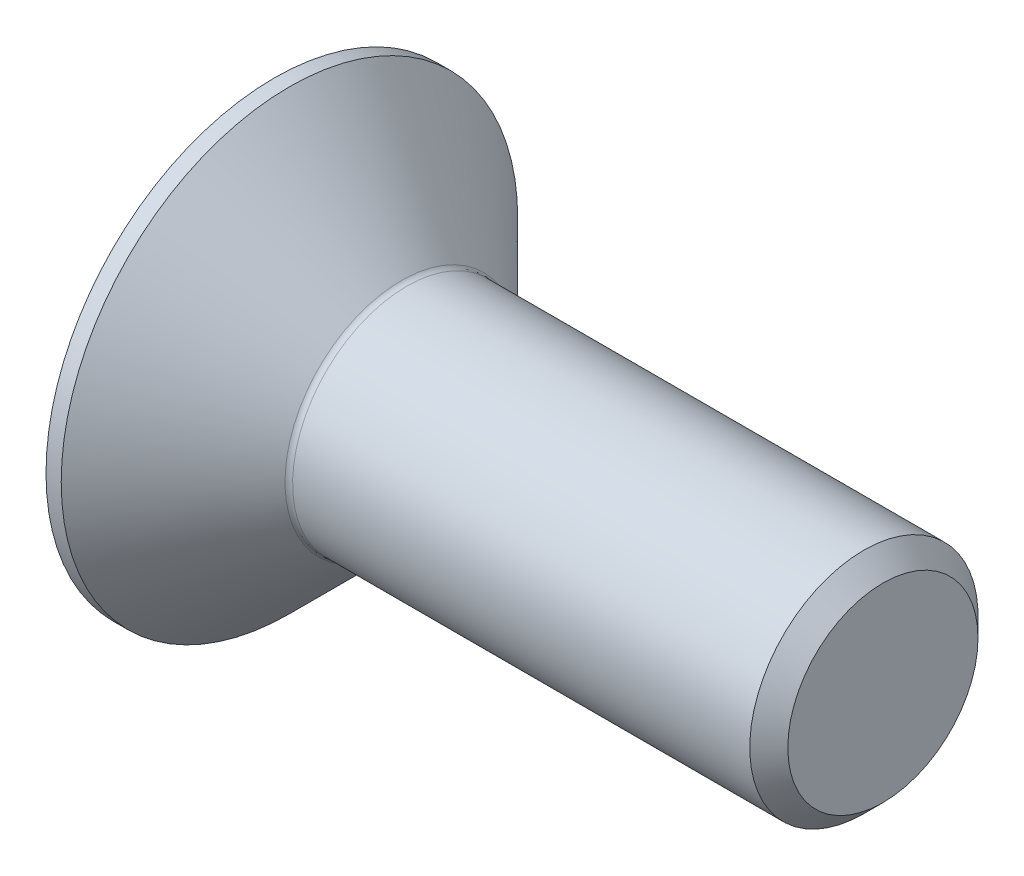
ISO-10303-21;
HEADER;
FILE_DESCRIPTION(('STEP AP214'),'2;1');
FILE_NAME('part.step','',(''),(''),'','','');
FILE_SCHEMA(('AUTOMOTIVE_DESIGN { 1 0 10303 214 1 1 1 1 }'));
ENDSEC;
DATA;
#1=APPLICATION_CONTEXT('core data for automotive mechanical design processes');
#2=APPLICATION_PROTOCOL_DEFINITION('international standard','automotive_design',2000,#1);
#3=PRODUCT_CONTEXT('',#1,'mechanical');
#4=PRODUCT('Part','Part','',(#3));
#5=PRODUCT_RELATED_PRODUCT_CATEGORY('part','',(#4));
#6=PRODUCT_DEFINITION_FORMATION('','',#4);
#7=PRODUCT_DEFINITION_CONTEXT('part definition',#1,'design');
#8=PRODUCT_DEFINITION('design','',#6,#7);
#9=PRODUCT_DEFINITION_SHAPE('','',#8);
#10=(LENGTH_UNIT() NAMED_UNIT(*) SI_UNIT(.MILLI.,.METRE.));
#11=(NAMED_UNIT(*) PLANE_ANGLE_UNIT() SI_UNIT($,.RADIAN.));
#12=(NAMED_UNIT(*) SI_UNIT($,.STERADIAN.) SOLID_ANGLE_UNIT());
#13=UNCERTAINTY_MEASURE_WITH_UNIT(LENGTH_MEASURE(1.E-05),#10,'distance_accuracy_value','');
#14=(GEOMETRIC_REPRESENTATION_CONTEXT(3) GLOBAL_UNCERTAINTY_ASSIGNED_CONTEXT((#13)) GLOBAL_UNIT_ASSIGNED_CONTEXT((#10,
#11,#12)) REPRESENTATION_CONTEXT('',''));
#15=CARTESIAN_POINT('',(0.,0.,0.));
#16=DIRECTION('',(0.,0.,1.));
#17=DIRECTION('',(1.,0.,0.));
#18=AXIS2_PLACEMENT_3D('',#15,#16,#17);
#19=CARTESIAN_POINT('',(1.2,0.,0.));
#20=DIRECTION('',(1.,0.,0.));
#21=DIRECTION('',(0.,1.,0.));
#22=AXIS2_PLACEMENT_3D('',#19,#20,#21);
#23=PLANE('',#22);
#24=DIRECTION('',(0.,-0.5,-0.866025403784439));
#25=VECTOR('',#24,1.);
#26=CARTESIAN_POINT('',(1.2,-1.15470053837925,0.));
#27=LINE('',#26,#25);
#28=CARTESIAN_POINT('',(1.2,-1.15470053837925,0.));
#29=VERTEX_POINT('',#28);
#30=CARTESIAN_POINT('',(1.2,-0.577350269189626,1.));
#31=VERTEX_POINT('',#30);
#32=EDGE_CURVE('E123',#29,#31,#27,.F.);
#33=ORIENTED_EDGE('',*,*,#32,.T.);
#34=DIRECTION('',(0.,-1.,0.));
#35=VECTOR('',#34,1.);
#36=CARTESIAN_POINT('',(1.2,-0.577350269189626,1.));
#37=LINE('',#36,#35);
#38=CARTESIAN_POINT('',(1.2,0.577350269189626,1.));
#39=VERTEX_POINT('',#38);
#40=EDGE_CURVE('E127',#31,#39,#37,.F.);
#41=ORIENTED_EDGE('',*,*,#40,.T.);
#42=DIRECTION('',(0.,-0.499999999999999,0.866025403784439));
#43=VECTOR('',#42,1.);
#44=CARTESIAN_POINT('',(1.2,0.577350269189626,1.));
#45=LINE('',#44,#43);
#46=CARTESIAN_POINT('',(1.2,1.15470053837925,0.));
#47=VERTEX_POINT('',#46);
#48=EDGE_CURVE('E132',#39,#47,#45,.F.);
#49=ORIENTED_EDGE('',*,*,#48,.T.);
#50=DIRECTION('',(0.,0.5,0.866025403784439));
#51=VECTOR('',#50,1.);
#52=CARTESIAN_POINT('',(1.2,1.15470053837925,0.));
#53=LINE('',#52,#51);
#54=CARTESIAN_POINT('',(1.2,0.577350269189626,-1.));
#55=VERTEX_POINT('',#54);
#56=EDGE_CURVE('E82',#47,#55,#53,.F.);
#57=ORIENTED_EDGE('',*,*,#56,.T.);
#58=DIRECTION('',(0.,1.,0.));
#59=VECTOR('',#58,1.);
#60=CARTESIAN_POINT('',(1.2,0.577350269189626,-1.));
#61=LINE('',#60,#59);
#62=CARTESIAN_POINT('',(1.2,-0.577350269189627,-1.));
#63=VERTEX_POINT('',#62);
#64=EDGE_CURVE('E66',#55,#63,#61,.F.);
#65=ORIENTED_EDGE('',*,*,#64,.T.);
#66=DIRECTION('',(0.,0.499999999999999,-0.866025403784439));
#67=VECTOR('',#66,1.);
#68=CARTESIAN_POINT('',(1.2,-0.577350269189627,-1.));
#69=LINE('',#68,#67);
#70=EDGE_CURVE('E71',#63,#29,#69,.F.);
#71=ORIENTED_EDGE('',*,*,#70,.T.);
#72=EDGE_LOOP('',(#33,#41,#49,#57,#65,#71));
#73=FACE_BOUND('',#72,.T.);
#74=ADVANCED_FACE('F16',(#73),#23,.F.);
#75=CARTESIAN_POINT('',(0.,-0.577350269189626,-1.));
#76=DIRECTION('',(0.,-0.866025403784439,-0.499999999999999));
#77=DIRECTION('',(0.,0.499999999999999,-0.866025403784439));
#78=AXIS2_PLACEMENT_3D('',#75,#76,#77);
#79=PLANE('',#78);
#80=DIRECTION('',(1.,0.,0.));
#81=VECTOR('',#80,1.);
#82=CARTESIAN_POINT('',(0.,-0.577350269189627,-1.));
#83=LINE('',#82,#81);
#84=CARTESIAN_POINT('',(0.,-0.577350269189626,-1.));
#85=VERTEX_POINT('',#84);
#86=EDGE_CURVE('E73',#63,#85,#83,.F.);
#87=ORIENTED_EDGE('',*,*,#86,.T.);
#88=DIRECTION('',(0.,0.499999999999999,-0.866025403784439));
#89=VECTOR('',#88,1.);
#90=CARTESIAN_POINT('',(0.,-1.15470053837925,0.));
#91=LINE('',#90,#89);
#92=CARTESIAN_POINT('',(0.,-1.15470053837925,0.));
#93=VERTEX_POINT('',#92);
#94=EDGE_CURVE('E121',#93,#85,#91,.T.);
#95=ORIENTED_EDGE('',*,*,#94,.F.);
#96=DIRECTION('',(1.,0.,0.));
#97=VECTOR('',#96,1.);
#98=CARTESIAN_POINT('',(0.,-1.15470053837925,0.));
#99=LINE('',#98,#97);
#100=EDGE_CURVE('E76',#93,#29,#99,.T.);
#101=ORIENTED_EDGE('',*,*,#100,.T.);
#102=ORIENTED_EDGE('',*,*,#70,.F.);
#103=EDGE_LOOP('',(#87,#95,#101,#102));
#104=FACE_BOUND('',#103,.T.);
#105=ADVANCED_FACE('F72',(#104),#79,.F.);
#106=CARTESIAN_POINT('',(0.,0.577350269189626,-1.));
#107=DIRECTION('',(0.,0.,-1.));
#108=DIRECTION('',(0.,1.,0.));
#109=AXIS2_PLACEMENT_3D('',#106,#107,#108);
#110=PLANE('',#109);
#111=DIRECTION('',(1.,0.,0.));
#112=VECTOR('',#111,1.);
#113=CARTESIAN_POINT('',(0.,0.577350269189625,-1.));
#114=LINE('',#113,#112);
#115=CARTESIAN_POINT('',(0.,0.577350269189626,-1.));
#116=VERTEX_POINT('',#115);
#117=EDGE_CURVE('E84',#55,#116,#114,.F.);
#118=ORIENTED_EDGE('',*,*,#117,.T.);
#119=DIRECTION('',(0.,-1.,0.));
#120=VECTOR('',#119,1.);
#121=CARTESIAN_POINT('',(0.,-1.5,-1.));
#122=LINE('',#121,#120);
#123=EDGE_CURVE('E88',#85,#116,#122,.F.);
#124=ORIENTED_EDGE('',*,*,#123,.F.);
#125=ORIENTED_EDGE('',*,*,#86,.F.);
#126=ORIENTED_EDGE('',*,*,#64,.F.);
#127=EDGE_LOOP('',(#118,#124,#125,#126));
#128=FACE_BOUND('',#127,.T.);
#129=ADVANCED_FACE('F86',(#128),#110,.F.);
#130=CARTESIAN_POINT('',(0.,1.15470053837925,0.));
#131=DIRECTION('',(0.,0.866025403784439,-0.5));
#132=DIRECTION('',(0.,0.5,0.866025403784439));
#133=AXIS2_PLACEMENT_3D('',#130,#131,#132);
#134=PLANE('',#133);
#135=DIRECTION('',(1.,0.,0.));
#136=VECTOR('',#135,1.);
#137=CARTESIAN_POINT('',(0.,1.15470053837925,0.));
#138=LINE('',#137,#136);
#139=CARTESIAN_POINT('',(0.,1.15470053837925,0.));
#140=VERTEX_POINT('',#139);
#141=EDGE_CURVE('E134',#47,#140,#138,.F.);
#142=ORIENTED_EDGE('',*,*,#141,.T.);
#143=DIRECTION('',(0.,0.499999999999999,0.866025403784439));
#144=VECTOR('',#143,1.);
#145=CARTESIAN_POINT('',(0.,0.577350269189626,-1.));
#146=LINE('',#145,#144);
#147=EDGE_CURVE('E117',#116,#140,#146,.T.);
#148=ORIENTED_EDGE('',*,*,#147,.F.);
#149=ORIENTED_EDGE('',*,*,#117,.F.);
#150=ORIENTED_EDGE('',*,*,#56,.F.);
#151=EDGE_LOOP('',(#142,#148,#149,#150));
#152=FACE_BOUND('',#151,.T.);
#153=ADVANCED_FACE('F138',(#152),#134,.F.);
#154=CARTESIAN_POINT('',(0.,0.577350269189626,1.));
#155=DIRECTION('',(0.,0.866025403784439,0.499999999999999));
#156=DIRECTION('',(0.,-0.499999999999999,0.866025403784439));
#157=AXIS2_PLACEMENT_3D('',#154,#155,#156);
#158=PLANE('',#157);
#159=DIRECTION('',(1.,0.,0.));
#160=VECTOR('',#159,1.);
#161=CARTESIAN_POINT('',(0.,0.577350269189626,1.));
#162=LINE('',#161,#160);
#163=CARTESIAN_POINT('',(0.,0.577350269189626,1.));
#164=VERTEX_POINT('',#163);
#165=EDGE_CURVE('E130',#39,#164,#162,.F.);
#166=ORIENTED_EDGE('',*,*,#165,.T.);
#167=DIRECTION('',(0.,-0.499999999999999,0.866025403784439));
#168=VECTOR('',#167,1.);
#169=CARTESIAN_POINT('',(0.,1.15470053837925,0.));
#170=LINE('',#169,#168);
#171=EDGE_CURVE('E114',#140,#164,#170,.T.);
#172=ORIENTED_EDGE('',*,*,#171,.F.);
#173=ORIENTED_EDGE('',*,*,#141,.F.);
#174=ORIENTED_EDGE('',*,*,#48,.F.);
#175=EDGE_LOOP('',(#166,#172,#173,#174));
#176=FACE_BOUND('',#175,.T.);
#177=ADVANCED_FACE('F149',(#176),#158,.F.);
#178=CARTESIAN_POINT('',(0.,-0.577350269189626,1.));
#179=DIRECTION('',(0.,0.,1.));
#180=DIRECTION('',(0.,-1.,0.));
#181=AXIS2_PLACEMENT_3D('',#178,#179,#180);
#182=PLANE('',#181);
#183=DIRECTION('',(1.,0.,0.));
#184=VECTOR('',#183,1.);
#185=CARTESIAN_POINT('',(0.,-0.577350269189625,1.));
#186=LINE('',#185,#184);
#187=CARTESIAN_POINT('',(0.,-0.577350269189626,1.));
#188=VERTEX_POINT('',#187);
#189=EDGE_CURVE('E34',#31,#188,#186,.F.);
#190=ORIENTED_EDGE('',*,*,#189,.T.);
#191=DIRECTION('',(0.,-1.,0.));
#192=VECTOR('',#191,1.);
#193=CARTESIAN_POINT('',(0.,-1.5,1.));
#194=LINE('',#193,#192);
#195=EDGE_CURVE('E111',#164,#188,#194,.T.);
#196=ORIENTED_EDGE('',*,*,#195,.F.);
#197=ORIENTED_EDGE('',*,*,#165,.F.);
#198=ORIENTED_EDGE('',*,*,#40,.F.);
#199=EDGE_LOOP('',(#190,#196,#197,#198));
#200=FACE_BOUND('',#199,.T.);
#201=ADVANCED_FACE('F147',(#200),#182,.F.);
#202=CARTESIAN_POINT('',(0.,-1.15470053837925,0.));
#203=DIRECTION('',(0.,-0.866025403784439,0.5));
#204=DIRECTION('',(0.,-0.5,-0.866025403784439));
#205=AXIS2_PLACEMENT_3D('',#202,#203,#204);
#206=PLANE('',#205);
#207=ORIENTED_EDGE('',*,*,#100,.F.);
#208=DIRECTION('',(0.,-0.499999999999999,-0.866025403784439));
#209=VECTOR('',#208,1.);
#210=CARTESIAN_POINT('',(0.,-0.577350269189626,1.));
#211=LINE('',#210,#209);
#212=EDGE_CURVE('E105',#188,#93,#211,.T.);
#213=ORIENTED_EDGE('',*,*,#212,.F.);
#214=ORIENTED_EDGE('',*,*,#189,.F.);
#215=ORIENTED_EDGE('',*,*,#32,.F.);
#216=EDGE_LOOP('',(#207,#213,#214,#215));
#217=FACE_BOUND('',#216,.T.);
#218=ADVANCED_FACE('F145',(#217),#206,.F.);
#219=CARTESIAN_POINT('',(0.,-1.5,0.));
#220=DIRECTION('',(-1.,0.,0.));
#221=DIRECTION('',(0.,-1.,0.));
#222=AXIS2_PLACEMENT_3D('',#219,#220,#221);
#223=PLANE('',#222);
#224=ORIENTED_EDGE('',*,*,#195,.T.);
#225=ORIENTED_EDGE('',*,*,#212,.T.);
#226=ORIENTED_EDGE('',*,*,#94,.T.);
#227=ORIENTED_EDGE('',*,*,#123,.T.);
#228=ORIENTED_EDGE('',*,*,#147,.T.);
#229=ORIENTED_EDGE('',*,*,#171,.T.);
#230=EDGE_LOOP('',(#224,#225,#226,#227,#228,#229));
#231=FACE_BOUND('',#230,.T.);
#232=CARTESIAN_POINT('',(0.,0.,0.));
#233=DIRECTION('',(1.,0.,0.));
#234=DIRECTION('',(0.,1.,0.));
#235=AXIS2_PLACEMENT_3D('',#232,#233,#234);
#236=CIRCLE('',#235,3.);
#237=CARTESIAN_POINT('',(0.,3.,0.));
#238=VERTEX_POINT('',#237);
#239=EDGE_CURVE('E19',#238,#238,#236,.T.);
#240=ORIENTED_EDGE('',*,*,#239,.F.);
#241=EDGE_LOOP('',(#240));
#242=FACE_BOUND('',#241,.T.);
#243=ADVANCED_FACE('F142',(#231,#242),#223,.T.);
#244=CARTESIAN_POINT('',(0.100000000000001,0.,0.));
#245=DIRECTION('',(1.,0.,0.));
#246=DIRECTION('',(0.,1.,0.));
#247=AXIS2_PLACEMENT_3D('',#244,#245,#246);
#248=CYLINDRICAL_SURFACE('',#247,3.);
#249=ORIENTED_EDGE('',*,*,#239,.T.);
#250=EDGE_LOOP('',(#249));
#251=FACE_BOUND('',#250,.T.);
#252=CARTESIAN_POINT('',(0.200000000063484,0.,0.));
#253=DIRECTION('',(-1.,0.,0.));
#254=DIRECTION('',(0.,-1.,0.));
#255=AXIS2_PLACEMENT_3D('',#252,#253,#254);
#256=CIRCLE('',#255,2.9999999999859);
#257=CARTESIAN_POINT('',(0.200000000063483,-2.9999999999859,0.));
#258=VERTEX_POINT('',#257);
#259=EDGE_CURVE('E95',#258,#258,#256,.F.);
#260=ORIENTED_EDGE('',*,*,#259,.F.);
#261=EDGE_LOOP('',(#260));
#262=FACE_BOUND('',#261,.T.);
#263=ADVANCED_FACE('F190',(#251,#262),#248,.T.);
#264=CARTESIAN_POINT('',(8.,-0.750000000000005,0.));
#265=DIRECTION('',(1.,0.,0.));
#266=DIRECTION('',(0.,1.,0.));
#267=AXIS2_PLACEMENT_3D('',#264,#265,#266);
#268=PLANE('',#267);
#269=CARTESIAN_POINT('',(7.99999999998136,0.,0.));
#270=DIRECTION('',(-1.,0.,0.));
#271=DIRECTION('',(0.,-1.,0.));
#272=AXIS2_PLACEMENT_3D('',#269,#270,#271);
#273=CIRCLE('',#272,1.25000000002729);
#274=CARTESIAN_POINT('',(7.99999999998136,-1.25000000002729,0.));
#275=VERTEX_POINT('',#274);
#276=EDGE_CURVE('E92',#275,#275,#273,.T.);
#277=ORIENTED_EDGE('',*,*,#276,.F.);
#278=EDGE_LOOP('',(#277));
#279=FACE_BOUND('',#278,.T.);
#280=ADVANCED_FACE('F186',(#279),#268,.T.);
#281=CARTESIAN_POINT('',(0.200000000006641,0.,0.));
#282=DIRECTION('',(-1.,0.,0.));
#283=DIRECTION('',(0.,-1.,0.));
#284=AXIS2_PLACEMENT_3D('',#281,#282,#283);
#285=CONICAL_SURFACE('',#284,3.00000000009959,0.785398163397449);
#286=ORIENTED_EDGE('',*,*,#259,.T.);
#287=EDGE_LOOP('',(#286));
#288=FACE_BOUND('',#287,.T.);
#289=CARTESIAN_POINT('',(1.67071067811866,0.,0.));
#290=DIRECTION('',(1.,0.,0.));
#291=DIRECTION('',(0.,0.,-1.));
#292=AXIS2_PLACEMENT_3D('',#289,#290,#291);
#293=CIRCLE('',#292,1.52928932188134);
#294=CARTESIAN_POINT('',(1.67071067811866,0.,-1.52928932188134));
#295=VERTEX_POINT('',#294);
#296=EDGE_CURVE('E94',#295,#295,#293,.F.);
#297=ORIENTED_EDGE('',*,*,#296,.T.);
#298=EDGE_LOOP('',(#297));
#299=FACE_BOUND('',#298,.T.);
#300=ADVANCED_FACE('F182',(#288,#299),#285,.T.);
#301=CARTESIAN_POINT('',(7.75000000004411,0.,0.));
#302=DIRECTION('',(-1.,0.,0.));
#303=DIRECTION('',(0.,-1.,0.));
#304=AXIS2_PLACEMENT_3D('',#301,#302,#303);
#305=CONICAL_SURFACE('',#304,1.49999999990769,0.785398163283761);
#306=CARTESIAN_POINT('',(7.75000000000001,0.,0.));
#307=DIRECTION('',(1.,0.,0.));
#308=DIRECTION('',(0.,1.,0.));
#309=AXIS2_PLACEMENT_3D('',#306,#307,#308);
#310=CIRCLE('',#309,1.5);
#311=CARTESIAN_POINT('',(7.75000000000001,1.5,0.));
#312=VERTEX_POINT('',#311);
#313=EDGE_CURVE('E25',#312,#312,#310,.F.);
#314=ORIENTED_EDGE('',*,*,#313,.F.);
#315=EDGE_LOOP('',(#314));
#316=FACE_BOUND('',#315,.T.);
#317=ORIENTED_EDGE('',*,*,#276,.T.);
#318=EDGE_LOOP('',(#317));
#319=FACE_BOUND('',#318,.T.);
#320=ADVANCED_FACE('F167',(#316,#319),#305,.T.);
#321=CARTESIAN_POINT('',(1.74142135623731,0.,0.));
#322=DIRECTION('',(1.,0.,0.));
#323=DIRECTION('',(0.,0.,-1.));
#324=AXIS2_PLACEMENT_3D('',#321,#322,#323);
#325=TOROIDAL_SURFACE('',#324,1.6,0.1);
#326=CARTESIAN_POINT('',(1.74142135623731,0.,0.));
#327=DIRECTION('',(1.,0.,0.));
#328=DIRECTION('',(0.,1.,0.));
#329=AXIS2_PLACEMENT_3D('',#326,#327,#328);
#330=CIRCLE('',#329,1.5);
#331=CARTESIAN_POINT('',(1.74142135623731,1.5,0.));
#332=VERTEX_POINT('',#331);
#333=EDGE_CURVE('E11',#332,#332,#330,.T.);
#334=ORIENTED_EDGE('',*,*,#333,.F.);
#335=EDGE_LOOP('',(#334));
#336=FACE_BOUND('',#335,.T.);
#337=ORIENTED_EDGE('',*,*,#296,.F.);
#338=EDGE_LOOP('',(#337));
#339=FACE_BOUND('',#338,.T.);
#340=ADVANCED_FACE('F161',(#336,#339),#325,.F.);
#341=CARTESIAN_POINT('',(4.85,0.,0.));
#342=DIRECTION('',(1.,0.,0.));
#343=DIRECTION('',(0.,1.,0.));
#344=AXIS2_PLACEMENT_3D('',#341,#342,#343);
#345=CYLINDRICAL_SURFACE('',#344,1.5);
#346=ORIENTED_EDGE('',*,*,#333,.T.);
#347=EDGE_LOOP('',(#346));
#348=FACE_BOUND('',#347,.T.);
#349=ORIENTED_EDGE('',*,*,#313,.T.);
#350=EDGE_LOOP('',(#349));
#351=FACE_BOUND('',#350,.T.);
#352=ADVANCED_FACE('F159',(#348,#351),#345,.T.);
#353=CLOSED_SHELL('',(#74,#105,#129,#153,#177,#201,#218,#243,#263,#280,#300,#320,#340,#352));
#354=MANIFOLD_SOLID_BREP('B1',#353);
#355=ADVANCED_BREP_SHAPE_REPRESENTATION('',(#18,#354),#14);
#356=SHAPE_DEFINITION_REPRESENTATION(#9,#355);
ENDSEC;
END-ISO-10303-21;
